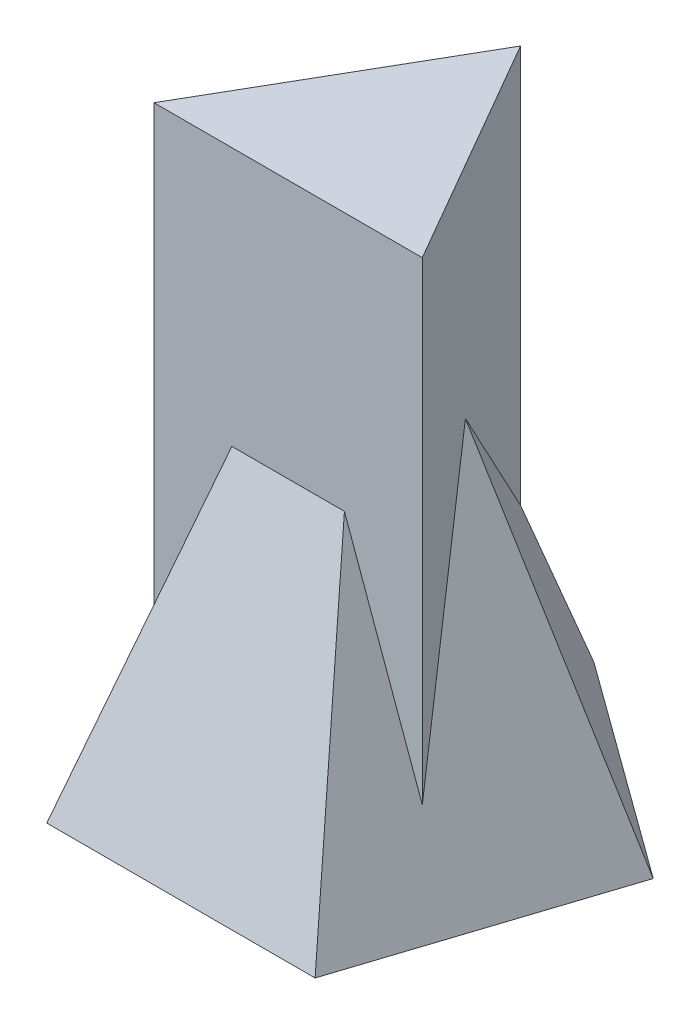
ISO-10303-21;
HEADER;
FILE_DESCRIPTION(('STEP AP214'),'2;1');
FILE_NAME('part.step','',(''),(''),'','','');
FILE_SCHEMA(('AUTOMOTIVE_DESIGN { 1 0 10303 214 1 1 1 1 }'));
ENDSEC;
DATA;
#1=APPLICATION_CONTEXT('core data for automotive mechanical design processes');
#2=APPLICATION_PROTOCOL_DEFINITION('international standard','automotive_design',2000,#1);
#3=PRODUCT_CONTEXT('',#1,'mechanical');
#4=PRODUCT('Part','Part','',(#3));
#5=PRODUCT_RELATED_PRODUCT_CATEGORY('part','',(#4));
#6=PRODUCT_DEFINITION_FORMATION('','',#4);
#7=PRODUCT_DEFINITION_CONTEXT('part definition',#1,'design');
#8=PRODUCT_DEFINITION('design','',#6,#7);
#9=PRODUCT_DEFINITION_SHAPE('','',#8);
#10=(LENGTH_UNIT() NAMED_UNIT(*) SI_UNIT(.MILLI.,.METRE.));
#11=(NAMED_UNIT(*) PLANE_ANGLE_UNIT() SI_UNIT($,.RADIAN.));
#12=(NAMED_UNIT(*) SI_UNIT($,.STERADIAN.) SOLID_ANGLE_UNIT());
#13=UNCERTAINTY_MEASURE_WITH_UNIT(LENGTH_MEASURE(1.E-05),#10,'distance_accuracy_value','');
#14=(GEOMETRIC_REPRESENTATION_CONTEXT(3) GLOBAL_UNCERTAINTY_ASSIGNED_CONTEXT((#13)) GLOBAL_UNIT_ASSIGNED_CONTEXT((#10,
#11,#12)) REPRESENTATION_CONTEXT('',''));
#15=CARTESIAN_POINT('',(0.,0.,0.));
#16=DIRECTION('',(0.,0.,1.));
#17=DIRECTION('',(1.,0.,0.));
#18=AXIS2_PLACEMENT_3D('',#15,#16,#17);
#19=CARTESIAN_POINT('',(-14.4673777727957,8.46935046662003,-19.9126372031025));
#20=DIRECTION('',(-0.555801578853052,0.325371911560833,-0.764995244502673));
#21=DIRECTION('',(-0.809016994374947,0.,0.587785252292473));
#22=AXIS2_PLACEMENT_3D('',#19,#20,#21);
#23=PLANE('',#22);
#24=DIRECTION('',(-0.372238059153741,-0.920223089853224,-0.12094747710656));
#25=VECTOR('',#24,1.);
#26=CARTESIAN_POINT('',(0.,80.,0.));
#27=LINE('',#26,#25);
#28=CARTESIAN_POINT('',(-11.2271958809821,52.244845388801,-3.64793707519603));
#29=VERTEX_POINT('',#28);
#30=CARTESIAN_POINT('',(-32.3606797749979,0.,-10.5146222423827));
#31=VERTEX_POINT('',#30);
#32=EDGE_CURVE('E45',#29,#31,#27,.T.);
#33=ORIENTED_EDGE('',*,*,#32,.F.);
#34=DIRECTION('',(0.322934861255873,-0.763447641651082,-0.559339587230379));
#35=VECTOR('',#34,1.);
#36=CARTESIAN_POINT('',(2.16537181125272,20.5835865809826,-26.8445447619522));
#37=LINE('',#36,#35);
#38=CARTESIAN_POINT('',(0.,25.7027242181197,-23.094010767585));
#39=VERTEX_POINT('',#38);
#40=EDGE_CURVE('E140',#29,#39,#37,.T.);
#41=ORIENTED_EDGE('',*,*,#40,.T.);
#42=DIRECTION('',(0.,-0.920223089853224,-0.391394257623928));
#43=VECTOR('',#42,1.);
#44=CARTESIAN_POINT('',(0.,80.,0.));
#45=LINE('',#44,#43);
#46=CARTESIAN_POINT('',(0.,0.,-34.0260323340816));
#47=VERTEX_POINT('',#46);
#48=EDGE_CURVE('E190',#39,#47,#45,.T.);
#49=ORIENTED_EDGE('',*,*,#48,.T.);
#50=DIRECTION('',(-0.809016994374947,0.,0.587785252292473));
#51=VECTOR('',#50,1.);
#52=CARTESIAN_POINT('',(0.,0.,-34.0260323340816));
#53=LINE('',#52,#51);
#54=EDGE_CURVE('E207',#47,#31,#53,.T.);
#55=ORIENTED_EDGE('',*,*,#54,.T.);
#56=EDGE_LOOP('',(#33,#41,#49,#55));
#57=FACE_BOUND('',#56,.T.);
#58=ADVANCED_FACE('F40',(#57),#23,.T.);
#59=CARTESIAN_POINT('',(-23.4087089644682,8.46935046662003,7.60595060593952));
#60=DIRECTION('',(-0.899305845585092,0.325371911560833,0.292202182167985));
#61=DIRECTION('',(-0.340220292851717,-0.940345762117261,0.));
#62=AXIS2_PLACEMENT_3D('',#59,#60,#61);
#63=PLANE('',#62);
#64=DIRECTION('',(-0.230055772463306,-0.920223089853224,0.316644605918524));
#65=VECTOR('',#64,1.);
#66=CARTESIAN_POINT('',(0.,80.,0.));
#67=LINE('',#66,#65);
#68=CARTESIAN_POINT('',(-8.38939048243213,46.4424380702715,11.5470053837925));
#69=VERTEX_POINT('',#68);
#70=CARTESIAN_POINT('',(-20.,0.,27.5276384094235));
#71=VERTEX_POINT('',#70);
#72=EDGE_CURVE('E66',#69,#71,#67,.T.);
#73=ORIENTED_EDGE('',*,*,#72,.F.);
#74=DIRECTION('',(-0.340220292851717,-0.940345762117261,0.));
#75=VECTOR('',#74,1.);
#76=CARTESIAN_POINT('',(-22.2764033698315,8.0596784539153,11.5470053837925));
#77=LINE('',#76,#75);
#78=CARTESIAN_POINT('',(-20.,14.3515026239199,11.5470053837925));
#79=VERTEX_POINT('',#78);
#80=EDGE_CURVE('E59',#69,#79,#77,.T.);
#81=ORIENTED_EDGE('',*,*,#80,.T.);
#82=DIRECTION('',(0.210085389219931,0.907445048994836,-0.363878568056804));
#83=VECTOR('',#82,1.);
#84=CARTESIAN_POINT('',(-20.9705492107012,10.1593021128475,13.2280459279728));
#85=LINE('',#84,#83);
#86=EDGE_CURVE('E137',#79,#29,#85,.T.);
#87=ORIENTED_EDGE('',*,*,#86,.T.);
#88=ORIENTED_EDGE('',*,*,#32,.T.);
#89=DIRECTION('',(0.309016994374948,0.,0.951056516295154));
#90=VECTOR('',#89,1.);
#91=CARTESIAN_POINT('',(-32.3606797749979,0.,-10.5146222423827));
#92=LINE('',#91,#90);
#93=EDGE_CURVE('E146',#31,#71,#92,.T.);
#94=ORIENTED_EDGE('',*,*,#93,.T.);
#95=EDGE_LOOP('',(#73,#81,#87,#88,#94));
#96=FACE_BOUND('',#95,.T.);
#97=ADVANCED_FACE('F153',(#96),#63,.T.);
#98=CARTESIAN_POINT('',(14.4673777727957,8.46935046662003,-19.9126372031025));
#99=DIRECTION('',(0.555801578853052,0.325371911560833,-0.764995244502673));
#100=DIRECTION('',(-0.809016994374947,0.,-0.587785252292473));
#101=AXIS2_PLACEMENT_3D('',#98,#99,#100);
#102=PLANE('',#101);
#103=ORIENTED_EDGE('',*,*,#48,.F.);
#104=DIRECTION('',(0.322934861255873,0.763447641651083,0.559339587230379));
#105=VECTOR('',#104,1.);
#106=CARTESIAN_POINT('',(-2.16537181125272,20.5835865809826,-26.8445447619522));
#107=LINE('',#106,#105);
#108=CARTESIAN_POINT('',(11.2271958809821,52.2448453888011,-3.64793707519604));
#109=VERTEX_POINT('',#108);
#110=EDGE_CURVE('E134',#39,#109,#107,.T.);
#111=ORIENTED_EDGE('',*,*,#110,.T.);
#112=DIRECTION('',(0.372238059153741,-0.920223089853224,-0.12094747710656));
#113=VECTOR('',#112,1.);
#114=CARTESIAN_POINT('',(0.,80.,0.));
#115=LINE('',#114,#113);
#116=CARTESIAN_POINT('',(32.3606797749979,0.,-10.5146222423827));
#117=VERTEX_POINT('',#116);
#118=EDGE_CURVE('E188',#109,#117,#115,.T.);
#119=ORIENTED_EDGE('',*,*,#118,.T.);
#120=DIRECTION('',(-0.809016994374947,0.,-0.587785252292473));
#121=VECTOR('',#120,1.);
#122=CARTESIAN_POINT('',(32.3606797749979,0.,-10.5146222423827));
#123=LINE('',#122,#121);
#124=EDGE_CURVE('E281',#117,#47,#123,.T.);
#125=ORIENTED_EDGE('',*,*,#124,.T.);
#126=EDGE_LOOP('',(#103,#111,#119,#125));
#127=FACE_BOUND('',#126,.T.);
#128=ADVANCED_FACE('F163',(#127),#102,.T.);
#129=CARTESIAN_POINT('',(23.4087089644682,8.46935046662003,7.60595060593952));
#130=DIRECTION('',(0.899305845585092,0.325371911560833,0.292202182167985));
#131=DIRECTION('',(-0.340220292851717,0.940345762117261,0.));
#132=AXIS2_PLACEMENT_3D('',#129,#130,#131);
#133=PLANE('',#132);
#134=DIRECTION('',(0.210085389219931,-0.907445048994836,0.363878568056804));
#135=VECTOR('',#134,1.);
#136=CARTESIAN_POINT('',(20.9705492107012,10.1593021128475,13.2280459279728));
#137=LINE('',#136,#135);
#138=CARTESIAN_POINT('',(20.,14.3515026239201,11.5470053837925));
#139=VERTEX_POINT('',#138);
#140=EDGE_CURVE('E12',#109,#139,#137,.T.);
#141=ORIENTED_EDGE('',*,*,#140,.T.);
#142=DIRECTION('',(-0.340220292851717,0.940345762117261,0.));
#143=VECTOR('',#142,1.);
#144=CARTESIAN_POINT('',(22.2764033698315,8.0596784539153,11.5470053837925));
#145=LINE('',#144,#143);
#146=CARTESIAN_POINT('',(8.38939048243213,46.4424380702715,11.5470053837925));
#147=VERTEX_POINT('',#146);
#148=EDGE_CURVE('E126',#139,#147,#145,.T.);
#149=ORIENTED_EDGE('',*,*,#148,.T.);
#150=DIRECTION('',(0.230055772463306,-0.920223089853224,0.316644605918524));
#151=VECTOR('',#150,1.);
#152=CARTESIAN_POINT('',(0.,80.,0.));
#153=LINE('',#152,#151);
#154=CARTESIAN_POINT('',(20.,0.,27.5276384094235));
#155=VERTEX_POINT('',#154);
#156=EDGE_CURVE('E191',#147,#155,#153,.T.);
#157=ORIENTED_EDGE('',*,*,#156,.T.);
#158=DIRECTION('',(0.309016994374948,0.,-0.951056516295154));
#159=VECTOR('',#158,1.);
#160=CARTESIAN_POINT('',(20.,0.,27.5276384094235));
#161=LINE('',#160,#159);
#162=EDGE_CURVE('E275',#155,#117,#161,.T.);
#163=ORIENTED_EDGE('',*,*,#162,.T.);
#164=ORIENTED_EDGE('',*,*,#118,.F.);
#165=EDGE_LOOP('',(#141,#149,#157,#163,#164));
#166=FACE_BOUND('',#165,.T.);
#167=ADVANCED_FACE('F168',(#166),#133,.T.);
#168=CARTESIAN_POINT('',(0.,8.46935046662002,24.613373194326));
#169=DIRECTION('',(0.,0.325371911560833,0.945586124669376));
#170=DIRECTION('',(0.,-0.945586124669377,0.325371911560833));
#171=AXIS2_PLACEMENT_3D('',#168,#169,#170);
#172=PLANE('',#171);
#173=ORIENTED_EDGE('',*,*,#156,.F.);
#174=DIRECTION('',(-1.,0.,0.));
#175=VECTOR('',#174,1.);
#176=CARTESIAN_POINT('',(0.,46.4424380702715,11.5470053837925));
#177=LINE('',#176,#175);
#178=EDGE_CURVE('E51',#147,#69,#177,.T.);
#179=ORIENTED_EDGE('',*,*,#178,.T.);
#180=ORIENTED_EDGE('',*,*,#72,.T.);
#181=DIRECTION('',(1.,0.,0.));
#182=VECTOR('',#181,1.);
#183=CARTESIAN_POINT('',(-20.,0.,27.5276384094235));
#184=LINE('',#183,#182);
#185=EDGE_CURVE('E221',#71,#155,#184,.T.);
#186=ORIENTED_EDGE('',*,*,#185,.T.);
#187=EDGE_LOOP('',(#173,#179,#180,#186));
#188=FACE_BOUND('',#187,.T.);
#189=ADVANCED_FACE('F42',(#188),#172,.T.);
#190=CARTESIAN_POINT('',(0.,0.,0.));
#191=DIRECTION('',(0.,1.,0.));
#192=DIRECTION('',(0.,0.,1.));
#193=AXIS2_PLACEMENT_3D('',#190,#191,#192);
#194=PLANE('',#193);
#195=ORIENTED_EDGE('',*,*,#185,.F.);
#196=ORIENTED_EDGE('',*,*,#93,.F.);
#197=ORIENTED_EDGE('',*,*,#54,.F.);
#198=ORIENTED_EDGE('',*,*,#124,.F.);
#199=ORIENTED_EDGE('',*,*,#162,.F.);
#200=EDGE_LOOP('',(#195,#196,#197,#198,#199));
#201=FACE_BOUND('',#200,.T.);
#202=ADVANCED_FACE('F246',(#201),#194,.F.);
#203=CARTESIAN_POINT('',(-20.,85.,11.5470053837925));
#204=DIRECTION('',(0.,0.,-1.));
#205=DIRECTION('',(-1.,0.,0.));
#206=AXIS2_PLACEMENT_3D('',#203,#204,#205);
#207=PLANE('',#206);
#208=ORIENTED_EDGE('',*,*,#80,.F.);
#209=ORIENTED_EDGE('',*,*,#178,.F.);
#210=ORIENTED_EDGE('',*,*,#148,.F.);
#211=DIRECTION('',(0.,-1.,0.));
#212=VECTOR('',#211,1.);
#213=CARTESIAN_POINT('',(20.,85.,11.5470053837925));
#214=LINE('',#213,#212);
#215=CARTESIAN_POINT('',(20.,85.,11.5470053837925));
#216=VERTEX_POINT('',#215);
#217=EDGE_CURVE('E112',#216,#139,#214,.T.);
#218=ORIENTED_EDGE('',*,*,#217,.F.);
#219=DIRECTION('',(1.,0.,0.));
#220=VECTOR('',#219,1.);
#221=CARTESIAN_POINT('',(-20.,85.,11.5470053837925));
#222=LINE('',#221,#220);
#223=CARTESIAN_POINT('',(-20.,85.,11.5470053837925));
#224=VERTEX_POINT('',#223);
#225=EDGE_CURVE('E118',#224,#216,#222,.T.);
#226=ORIENTED_EDGE('',*,*,#225,.F.);
#227=DIRECTION('',(0.,-1.,0.));
#228=VECTOR('',#227,1.);
#229=CARTESIAN_POINT('',(-20.,85.,11.5470053837925));
#230=LINE('',#229,#228);
#231=EDGE_CURVE('E129',#224,#79,#230,.T.);
#232=ORIENTED_EDGE('',*,*,#231,.T.);
#233=EDGE_LOOP('',(#208,#209,#210,#218,#226,#232));
#234=FACE_BOUND('',#233,.T.);
#235=ADVANCED_FACE('F124',(#234),#207,.F.);
#236=CARTESIAN_POINT('',(20.,85.,11.5470053837925));
#237=DIRECTION('',(-0.866025403784439,0.,0.5));
#238=DIRECTION('',(0.5,0.,0.866025403784439));
#239=AXIS2_PLACEMENT_3D('',#236,#237,#238);
#240=PLANE('',#239);
#241=ORIENTED_EDGE('',*,*,#110,.F.);
#242=DIRECTION('',(0.,-1.,0.));
#243=VECTOR('',#242,1.);
#244=CARTESIAN_POINT('',(0.,85.,-23.094010767585));
#245=LINE('',#244,#243);
#246=CARTESIAN_POINT('',(0.,85.,-23.094010767585));
#247=VERTEX_POINT('',#246);
#248=EDGE_CURVE('E114',#247,#39,#245,.T.);
#249=ORIENTED_EDGE('',*,*,#248,.F.);
#250=DIRECTION('',(-0.5,0.,-0.866025403784439));
#251=VECTOR('',#250,1.);
#252=CARTESIAN_POINT('',(20.,85.,11.5470053837925));
#253=LINE('',#252,#251);
#254=EDGE_CURVE('E108',#216,#247,#253,.T.);
#255=ORIENTED_EDGE('',*,*,#254,.F.);
#256=ORIENTED_EDGE('',*,*,#217,.T.);
#257=ORIENTED_EDGE('',*,*,#140,.F.);
#258=EDGE_LOOP('',(#241,#249,#255,#256,#257));
#259=FACE_BOUND('',#258,.T.);
#260=ADVANCED_FACE('F110',(#259),#240,.F.);
#261=CARTESIAN_POINT('',(0.,85.,-23.094010767585));
#262=DIRECTION('',(0.866025403784439,0.,0.5));
#263=DIRECTION('',(0.5,0.,-0.866025403784439));
#264=AXIS2_PLACEMENT_3D('',#261,#262,#263);
#265=PLANE('',#264);
#266=ORIENTED_EDGE('',*,*,#40,.F.);
#267=ORIENTED_EDGE('',*,*,#86,.F.);
#268=ORIENTED_EDGE('',*,*,#231,.F.);
#269=DIRECTION('',(-0.5,0.,0.866025403784439));
#270=VECTOR('',#269,1.);
#271=CARTESIAN_POINT('',(0.,85.,-23.094010767585));
#272=LINE('',#271,#270);
#273=EDGE_CURVE('E117',#247,#224,#272,.T.);
#274=ORIENTED_EDGE('',*,*,#273,.F.);
#275=ORIENTED_EDGE('',*,*,#248,.T.);
#276=EDGE_LOOP('',(#266,#267,#268,#274,#275));
#277=FACE_BOUND('',#276,.T.);
#278=ADVANCED_FACE('F287',(#277),#265,.F.);
#279=CARTESIAN_POINT('',(0.,85.,0.));
#280=DIRECTION('',(0.,1.,0.));
#281=DIRECTION('',(0.,0.,1.));
#282=AXIS2_PLACEMENT_3D('',#279,#280,#281);
#283=PLANE('',#282);
#284=ORIENTED_EDGE('',*,*,#225,.T.);
#285=ORIENTED_EDGE('',*,*,#254,.T.);
#286=ORIENTED_EDGE('',*,*,#273,.T.);
#287=EDGE_LOOP('',(#284,#285,#286));
#288=FACE_BOUND('',#287,.T.);
#289=ADVANCED_FACE('F121',(#288),#283,.T.);
#290=CLOSED_SHELL('',(#58,#97,#128,#167,#189,#202,#235,#260,#278,#289));
#291=MANIFOLD_SOLID_BREP('B2',#290);
#292=ADVANCED_BREP_SHAPE_REPRESENTATION('',(#18,#291),#14);
#293=SHAPE_DEFINITION_REPRESENTATION(#9,#292);
ENDSEC;
END-ISO-10303-21;
